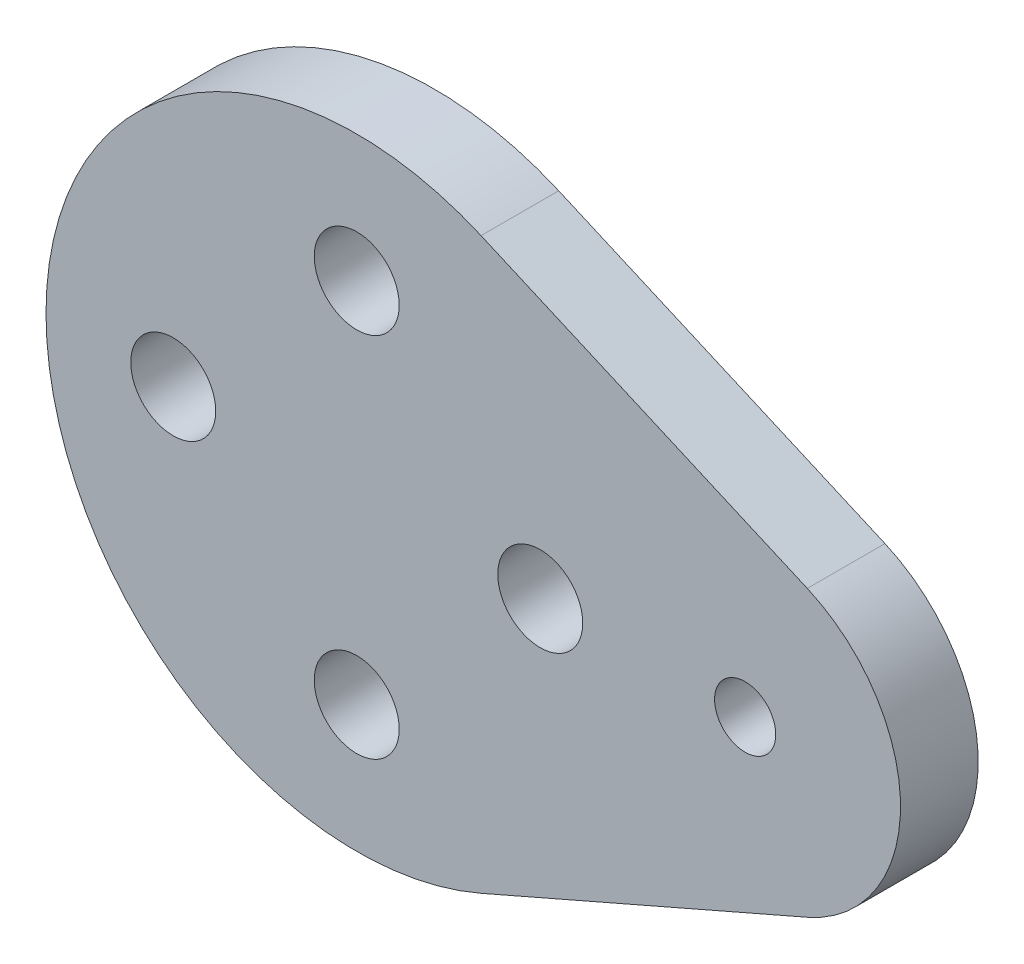
ISO-10303-21;
HEADER;
FILE_DESCRIPTION(('STEP AP214'),'2;1');
FILE_NAME('part.step','',(''),(''),'','','');
FILE_SCHEMA(('AUTOMOTIVE_DESIGN { 1 0 10303 214 1 1 1 1 }'));
ENDSEC;
DATA;
#1=APPLICATION_CONTEXT('core data for automotive mechanical design processes');
#2=APPLICATION_PROTOCOL_DEFINITION('international standard','automotive_design',2000,#1);
#3=PRODUCT_CONTEXT('',#1,'mechanical');
#4=PRODUCT('Part','Part','',(#3));
#5=PRODUCT_RELATED_PRODUCT_CATEGORY('part','',(#4));
#6=PRODUCT_DEFINITION_FORMATION('','',#4);
#7=PRODUCT_DEFINITION_CONTEXT('part definition',#1,'design');
#8=PRODUCT_DEFINITION('design','',#6,#7);
#9=PRODUCT_DEFINITION_SHAPE('','',#8);
#10=(LENGTH_UNIT() NAMED_UNIT(*) SI_UNIT(.MILLI.,.METRE.));
#11=(NAMED_UNIT(*) PLANE_ANGLE_UNIT() SI_UNIT($,.RADIAN.));
#12=(NAMED_UNIT(*) SI_UNIT($,.STERADIAN.) SOLID_ANGLE_UNIT());
#13=UNCERTAINTY_MEASURE_WITH_UNIT(LENGTH_MEASURE(1.E-05),#10,'distance_accuracy_value','');
#14=(GEOMETRIC_REPRESENTATION_CONTEXT(3) GLOBAL_UNCERTAINTY_ASSIGNED_CONTEXT((#13)) GLOBAL_UNIT_ASSIGNED_CONTEXT((#10,
#11,#12)) REPRESENTATION_CONTEXT('',''));
#15=CARTESIAN_POINT('',(0.,0.,0.));
#16=DIRECTION('',(0.,0.,1.));
#17=DIRECTION('',(1.,0.,0.));
#18=AXIS2_PLACEMENT_3D('',#15,#16,#17);
#19=CARTESIAN_POINT('',(0.,0.,2.54));
#20=DIRECTION('',(0.,0.,1.));
#21=DIRECTION('',(1.,0.,0.));
#22=AXIS2_PLACEMENT_3D('',#19,#20,#21);
#23=PLANE('',#22);
#24=CARTESIAN_POINT('',(3.39590937005871E-13,-6.,2.54));
#25=DIRECTION('',(0.,0.,1.));
#26=DIRECTION('',(1.,0.,0.));
#27=AXIS2_PLACEMENT_3D('',#24,#25,#26);
#28=CIRCLE('',#27,1.38906250000036);
#29=CARTESIAN_POINT('',(1.3890625000007,-6.,2.54));
#30=VERTEX_POINT('',#29);
#31=EDGE_CURVE('E158',#30,#30,#28,.T.);
#32=ORIENTED_EDGE('',*,*,#31,.F.);
#33=EDGE_LOOP('',(#32));
#34=FACE_BOUND('',#33,.T.);
#35=CARTESIAN_POINT('',(0.,6.,2.54));
#36=DIRECTION('',(0.,0.,1.));
#37=DIRECTION('',(1.,0.,0.));
#38=AXIS2_PLACEMENT_3D('',#35,#36,#37);
#39=CIRCLE('',#38,1.3890625);
#40=CARTESIAN_POINT('',(1.3890625,6.,2.54));
#41=VERTEX_POINT('',#40);
#42=EDGE_CURVE('E143',#41,#41,#39,.T.);
#43=ORIENTED_EDGE('',*,*,#42,.F.);
#44=EDGE_LOOP('',(#43));
#45=FACE_BOUND('',#44,.T.);
#46=CARTESIAN_POINT('',(0.,0.,2.54));
#47=DIRECTION('',(0.,0.,1.));
#48=DIRECTION('',(1.,0.,0.));
#49=AXIS2_PLACEMENT_3D('',#46,#47,#48);
#50=CIRCLE('',#49,10.16);
#51=CARTESIAN_POINT('',(4.064,9.31179381215027,2.54));
#52=VERTEX_POINT('',#51);
#53=CARTESIAN_POINT('',(4.064,-9.31179381215027,2.54));
#54=VERTEX_POINT('',#53);
#55=EDGE_CURVE('E99',#52,#54,#50,.T.);
#56=ORIENTED_EDGE('',*,*,#55,.T.);
#57=DIRECTION('',(0.916515138991168,0.4,0.));
#58=VECTOR('',#57,1.);
#59=CARTESIAN_POINT('',(14.732,-4.65589690607513,2.54));
#60=LINE('',#59,#58);
#61=CARTESIAN_POINT('',(14.732,-4.65589690607513,2.54));
#62=VERTEX_POINT('',#61);
#63=EDGE_CURVE('E93',#54,#62,#60,.T.);
#64=ORIENTED_EDGE('',*,*,#63,.T.);
#65=CARTESIAN_POINT('',(12.7,0.,2.54));
#66=DIRECTION('',(0.,0.,1.));
#67=DIRECTION('',(1.,0.,0.));
#68=AXIS2_PLACEMENT_3D('',#65,#66,#67);
#69=CIRCLE('',#68,5.08);
#70=CARTESIAN_POINT('',(14.732,4.65589690607513,2.54));
#71=VERTEX_POINT('',#70);
#72=EDGE_CURVE('E97',#62,#71,#69,.T.);
#73=ORIENTED_EDGE('',*,*,#72,.T.);
#74=DIRECTION('',(-0.916515138991168,0.4,0.));
#75=VECTOR('',#74,1.);
#76=CARTESIAN_POINT('',(4.064,9.31179381215027,2.54));
#77=LINE('',#76,#75);
#78=EDGE_CURVE('E59',#71,#52,#77,.T.);
#79=ORIENTED_EDGE('',*,*,#78,.T.);
#80=EDGE_LOOP('',(#56,#64,#73,#79));
#81=FACE_BOUND('',#80,.T.);
#82=CARTESIAN_POINT('',(12.7,0.,2.54));
#83=DIRECTION('',(0.,0.,1.));
#84=DIRECTION('',(1.,0.,0.));
#85=AXIS2_PLACEMENT_3D('',#82,#83,#84);
#86=CIRCLE('',#85,1.);
#87=CARTESIAN_POINT('',(13.7,0.,2.54));
#88=VERTEX_POINT('',#87);
#89=EDGE_CURVE('E121',#88,#88,#86,.T.);
#90=ORIENTED_EDGE('',*,*,#89,.F.);
#91=EDGE_LOOP('',(#90));
#92=FACE_BOUND('',#91,.T.);
#93=CARTESIAN_POINT('',(6.00000000000017,1.69795468502936E-13,2.54));
#94=DIRECTION('',(0.,0.,1.));
#95=DIRECTION('',(1.,0.,0.));
#96=AXIS2_PLACEMENT_3D('',#93,#94,#95);
#97=CIRCLE('',#96,1.38906250000013);
#98=CARTESIAN_POINT('',(7.3890625000003,1.69795468502936E-13,2.54));
#99=VERTEX_POINT('',#98);
#100=EDGE_CURVE('E150',#99,#99,#97,.T.);
#101=ORIENTED_EDGE('',*,*,#100,.F.);
#102=EDGE_LOOP('',(#101));
#103=FACE_BOUND('',#102,.T.);
#104=CARTESIAN_POINT('',(-5.99999999999983,-1.70530256582424E-13,2.54));
#105=DIRECTION('',(0.,0.,1.));
#106=DIRECTION('',(1.,0.,0.));
#107=AXIS2_PLACEMENT_3D('',#104,#105,#106);
#108=CIRCLE('',#107,1.38906250000027);
#109=CARTESIAN_POINT('',(-4.61093749999956,-1.70530256582424E-13,2.54));
#110=VERTEX_POINT('',#109);
#111=EDGE_CURVE('E165',#110,#110,#108,.T.);
#112=ORIENTED_EDGE('',*,*,#111,.F.);
#113=EDGE_LOOP('',(#112));
#114=FACE_BOUND('',#113,.T.);
#115=ADVANCED_FACE('F38',(#34,#45,#81,#92,#103,#114),#23,.T.);
#116=CARTESIAN_POINT('',(0.,0.,0.));
#117=DIRECTION('',(0.,0.,1.));
#118=DIRECTION('',(1.,0.,0.));
#119=AXIS2_PLACEMENT_3D('',#116,#117,#118);
#120=PLANE('',#119);
#121=CARTESIAN_POINT('',(0.,0.,0.));
#122=DIRECTION('',(0.,0.,1.));
#123=DIRECTION('',(1.,0.,0.));
#124=AXIS2_PLACEMENT_3D('',#121,#122,#123);
#125=CIRCLE('',#124,10.16);
#126=CARTESIAN_POINT('',(4.064,9.31179381215027,0.));
#127=VERTEX_POINT('',#126);
#128=CARTESIAN_POINT('',(4.064,-9.31179381215027,0.));
#129=VERTEX_POINT('',#128);
#130=EDGE_CURVE('E117',#127,#129,#125,.T.);
#131=ORIENTED_EDGE('',*,*,#130,.F.);
#132=DIRECTION('',(-0.916515138991168,0.4,0.));
#133=VECTOR('',#132,1.);
#134=CARTESIAN_POINT('',(4.064,9.31179381215027,0.));
#135=LINE('',#134,#133);
#136=CARTESIAN_POINT('',(14.732,4.65589690607513,0.));
#137=VERTEX_POINT('',#136);
#138=EDGE_CURVE('E86',#137,#127,#135,.T.);
#139=ORIENTED_EDGE('',*,*,#138,.F.);
#140=CARTESIAN_POINT('',(12.7,0.,0.));
#141=DIRECTION('',(0.,0.,1.));
#142=DIRECTION('',(1.,0.,0.));
#143=AXIS2_PLACEMENT_3D('',#140,#141,#142);
#144=CIRCLE('',#143,5.08);
#145=CARTESIAN_POINT('',(14.732,-4.65589690607513,0.));
#146=VERTEX_POINT('',#145);
#147=EDGE_CURVE('E80',#146,#137,#144,.T.);
#148=ORIENTED_EDGE('',*,*,#147,.F.);
#149=DIRECTION('',(0.916515138991168,0.4,0.));
#150=VECTOR('',#149,1.);
#151=CARTESIAN_POINT('',(14.732,-4.65589690607513,0.));
#152=LINE('',#151,#150);
#153=EDGE_CURVE('E104',#129,#146,#152,.T.);
#154=ORIENTED_EDGE('',*,*,#153,.F.);
#155=EDGE_LOOP('',(#131,#139,#148,#154));
#156=FACE_BOUND('',#155,.T.);
#157=CARTESIAN_POINT('',(12.7,0.,0.));
#158=DIRECTION('',(0.,0.,1.));
#159=DIRECTION('',(1.,0.,0.));
#160=AXIS2_PLACEMENT_3D('',#157,#158,#159);
#161=CIRCLE('',#160,1.);
#162=CARTESIAN_POINT('',(13.7,0.,0.));
#163=VERTEX_POINT('',#162);
#164=EDGE_CURVE('E139',#163,#163,#161,.T.);
#165=ORIENTED_EDGE('',*,*,#164,.T.);
#166=EDGE_LOOP('',(#165));
#167=FACE_BOUND('',#166,.T.);
#168=CARTESIAN_POINT('',(0.,6.,0.));
#169=DIRECTION('',(0.,0.,1.));
#170=DIRECTION('',(1.,0.,0.));
#171=AXIS2_PLACEMENT_3D('',#168,#169,#170);
#172=CIRCLE('',#171,1.3890625);
#173=CARTESIAN_POINT('',(1.3890625,6.,0.));
#174=VERTEX_POINT('',#173);
#175=EDGE_CURVE('E146',#174,#174,#172,.T.);
#176=ORIENTED_EDGE('',*,*,#175,.T.);
#177=EDGE_LOOP('',(#176));
#178=FACE_BOUND('',#177,.T.);
#179=CARTESIAN_POINT('',(6.00000000000017,1.69795468502936E-13,0.));
#180=DIRECTION('',(0.,0.,1.));
#181=DIRECTION('',(1.,0.,0.));
#182=AXIS2_PLACEMENT_3D('',#179,#180,#181);
#183=CIRCLE('',#182,1.38906250000013);
#184=CARTESIAN_POINT('',(7.3890625000003,1.69795468502936E-13,0.));
#185=VERTEX_POINT('',#184);
#186=EDGE_CURVE('E154',#185,#185,#183,.T.);
#187=ORIENTED_EDGE('',*,*,#186,.T.);
#188=EDGE_LOOP('',(#187));
#189=FACE_BOUND('',#188,.T.);
#190=CARTESIAN_POINT('',(3.39590937005871E-13,-6.,0.));
#191=DIRECTION('',(0.,0.,1.));
#192=DIRECTION('',(1.,0.,0.));
#193=AXIS2_PLACEMENT_3D('',#190,#191,#192);
#194=CIRCLE('',#193,1.38906250000036);
#195=CARTESIAN_POINT('',(1.3890625000007,-6.,0.));
#196=VERTEX_POINT('',#195);
#197=EDGE_CURVE('E162',#196,#196,#194,.T.);
#198=ORIENTED_EDGE('',*,*,#197,.T.);
#199=EDGE_LOOP('',(#198));
#200=FACE_BOUND('',#199,.T.);
#201=CARTESIAN_POINT('',(-5.99999999999983,-1.70530256582424E-13,0.));
#202=DIRECTION('',(0.,0.,1.));
#203=DIRECTION('',(1.,0.,0.));
#204=AXIS2_PLACEMENT_3D('',#201,#202,#203);
#205=CIRCLE('',#204,1.38906250000027);
#206=CARTESIAN_POINT('',(-4.61093749999956,-1.70530256582424E-13,0.));
#207=VERTEX_POINT('',#206);
#208=EDGE_CURVE('E169',#207,#207,#205,.T.);
#209=ORIENTED_EDGE('',*,*,#208,.T.);
#210=EDGE_LOOP('',(#209));
#211=FACE_BOUND('',#210,.T.);
#212=ADVANCED_FACE('F133',(#156,#167,#178,#189,#200,#211),#120,.F.);
#213=CARTESIAN_POINT('',(0.,0.,2.54));
#214=DIRECTION('',(0.,0.,-1.));
#215=DIRECTION('',(-1.,0.,0.));
#216=AXIS2_PLACEMENT_3D('',#213,#214,#215);
#217=CYLINDRICAL_SURFACE('',#216,10.16);
#218=ORIENTED_EDGE('',*,*,#130,.T.);
#219=DIRECTION('',(0.,0.,-1.));
#220=VECTOR('',#219,1.);
#221=CARTESIAN_POINT('',(4.064,-9.31179381215027,2.54));
#222=LINE('',#221,#220);
#223=EDGE_CURVE('E11',#54,#129,#222,.T.);
#224=ORIENTED_EDGE('',*,*,#223,.F.);
#225=ORIENTED_EDGE('',*,*,#55,.F.);
#226=DIRECTION('',(0.,0.,-1.));
#227=VECTOR('',#226,1.);
#228=CARTESIAN_POINT('',(4.064,9.31179381215027,2.54));
#229=LINE('',#228,#227);
#230=EDGE_CURVE('E113',#52,#127,#229,.T.);
#231=ORIENTED_EDGE('',*,*,#230,.T.);
#232=EDGE_LOOP('',(#218,#224,#225,#231));
#233=FACE_BOUND('',#232,.T.);
#234=ADVANCED_FACE('F40',(#233),#217,.T.);
#235=CARTESIAN_POINT('',(14.732,-4.65589690607513,2.54));
#236=DIRECTION('',(-0.4,0.916515138991168,0.));
#237=DIRECTION('',(-0.916515138991168,-0.4,0.));
#238=AXIS2_PLACEMENT_3D('',#235,#236,#237);
#239=PLANE('',#238);
#240=ORIENTED_EDGE('',*,*,#153,.T.);
#241=DIRECTION('',(0.,0.,-1.));
#242=VECTOR('',#241,1.);
#243=CARTESIAN_POINT('',(14.732,-4.65589690607513,2.54));
#244=LINE('',#243,#242);
#245=EDGE_CURVE('E48',#62,#146,#244,.T.);
#246=ORIENTED_EDGE('',*,*,#245,.F.);
#247=ORIENTED_EDGE('',*,*,#63,.F.);
#248=ORIENTED_EDGE('',*,*,#223,.T.);
#249=EDGE_LOOP('',(#240,#246,#247,#248));
#250=FACE_BOUND('',#249,.T.);
#251=ADVANCED_FACE('F103',(#250),#239,.F.);
#252=CARTESIAN_POINT('',(12.7,0.,2.54));
#253=DIRECTION('',(0.,0.,-1.));
#254=DIRECTION('',(-1.,0.,0.));
#255=AXIS2_PLACEMENT_3D('',#252,#253,#254);
#256=CYLINDRICAL_SURFACE('',#255,5.08);
#257=ORIENTED_EDGE('',*,*,#147,.T.);
#258=DIRECTION('',(0.,0.,-1.));
#259=VECTOR('',#258,1.);
#260=CARTESIAN_POINT('',(14.732,4.65589690607513,2.54));
#261=LINE('',#260,#259);
#262=EDGE_CURVE('E106',#71,#137,#261,.T.);
#263=ORIENTED_EDGE('',*,*,#262,.F.);
#264=ORIENTED_EDGE('',*,*,#72,.F.);
#265=ORIENTED_EDGE('',*,*,#245,.T.);
#266=EDGE_LOOP('',(#257,#263,#264,#265));
#267=FACE_BOUND('',#266,.T.);
#268=ADVANCED_FACE('F107',(#267),#256,.T.);
#269=CARTESIAN_POINT('',(4.064,9.31179381215027,2.54));
#270=DIRECTION('',(-0.4,-0.916515138991168,0.));
#271=DIRECTION('',(0.916515138991168,-0.4,0.));
#272=AXIS2_PLACEMENT_3D('',#269,#270,#271);
#273=PLANE('',#272);
#274=ORIENTED_EDGE('',*,*,#138,.T.);
#275=ORIENTED_EDGE('',*,*,#230,.F.);
#276=ORIENTED_EDGE('',*,*,#78,.F.);
#277=ORIENTED_EDGE('',*,*,#262,.T.);
#278=EDGE_LOOP('',(#274,#275,#276,#277));
#279=FACE_BOUND('',#278,.T.);
#280=ADVANCED_FACE('F130',(#279),#273,.F.);
#281=CARTESIAN_POINT('',(12.7,0.,2.54));
#282=DIRECTION('',(0.,0.,-1.));
#283=DIRECTION('',(-1.,0.,0.));
#284=AXIS2_PLACEMENT_3D('',#281,#282,#283);
#285=CYLINDRICAL_SURFACE('',#284,1.);
#286=ORIENTED_EDGE('',*,*,#89,.T.);
#287=EDGE_LOOP('',(#286));
#288=FACE_BOUND('',#287,.T.);
#289=ORIENTED_EDGE('',*,*,#164,.F.);
#290=EDGE_LOOP('',(#289));
#291=FACE_BOUND('',#290,.T.);
#292=ADVANCED_FACE('F190',(#288,#291),#285,.F.);
#293=CARTESIAN_POINT('',(0.,6.,2.54));
#294=DIRECTION('',(0.,0.,-1.));
#295=DIRECTION('',(-1.,0.,0.));
#296=AXIS2_PLACEMENT_3D('',#293,#294,#295);
#297=CYLINDRICAL_SURFACE('',#296,1.3890625);
#298=ORIENTED_EDGE('',*,*,#42,.T.);
#299=EDGE_LOOP('',(#298));
#300=FACE_BOUND('',#299,.T.);
#301=ORIENTED_EDGE('',*,*,#175,.F.);
#302=EDGE_LOOP('',(#301));
#303=FACE_BOUND('',#302,.T.);
#304=ADVANCED_FACE('F241',(#300,#303),#297,.F.);
#305=CARTESIAN_POINT('',(6.00000000000017,1.69795468502936E-13,2.54));
#306=DIRECTION('',(0.,0.,-1.));
#307=DIRECTION('',(-1.,0.,0.));
#308=AXIS2_PLACEMENT_3D('',#305,#306,#307);
#309=CYLINDRICAL_SURFACE('',#308,1.38906250000013);
#310=ORIENTED_EDGE('',*,*,#100,.T.);
#311=EDGE_LOOP('',(#310));
#312=FACE_BOUND('',#311,.T.);
#313=ORIENTED_EDGE('',*,*,#186,.F.);
#314=EDGE_LOOP('',(#313));
#315=FACE_BOUND('',#314,.T.);
#316=ADVANCED_FACE('F250',(#312,#315),#309,.F.);
#317=CARTESIAN_POINT('',(3.39590937005871E-13,-6.,2.54));
#318=DIRECTION('',(0.,0.,-1.));
#319=DIRECTION('',(-1.,0.,0.));
#320=AXIS2_PLACEMENT_3D('',#317,#318,#319);
#321=CYLINDRICAL_SURFACE('',#320,1.38906250000036);
#322=ORIENTED_EDGE('',*,*,#31,.T.);
#323=EDGE_LOOP('',(#322));
#324=FACE_BOUND('',#323,.T.);
#325=ORIENTED_EDGE('',*,*,#197,.F.);
#326=EDGE_LOOP('',(#325));
#327=FACE_BOUND('',#326,.T.);
#328=ADVANCED_FACE('F258',(#324,#327),#321,.F.);
#329=CARTESIAN_POINT('',(-5.99999999999983,-1.70530256582424E-13,2.54));
#330=DIRECTION('',(0.,0.,-1.));
#331=DIRECTION('',(-1.,0.,0.));
#332=AXIS2_PLACEMENT_3D('',#329,#330,#331);
#333=CYLINDRICAL_SURFACE('',#332,1.38906250000027);
#334=ORIENTED_EDGE('',*,*,#111,.T.);
#335=EDGE_LOOP('',(#334));
#336=FACE_BOUND('',#335,.T.);
#337=ORIENTED_EDGE('',*,*,#208,.F.);
#338=EDGE_LOOP('',(#337));
#339=FACE_BOUND('',#338,.T.);
#340=ADVANCED_FACE('F177',(#336,#339),#333,.F.);
#341=CLOSED_SHELL('',(#115,#212,#234,#251,#268,#280,#292,#304,#316,#328,#340));
#342=MANIFOLD_SOLID_BREP('B2',#341);
#343=ADVANCED_BREP_SHAPE_REPRESENTATION('',(#18,#342),#14);
#344=SHAPE_DEFINITION_REPRESENTATION(#9,#343);
ENDSEC;
END-ISO-10303-21;
